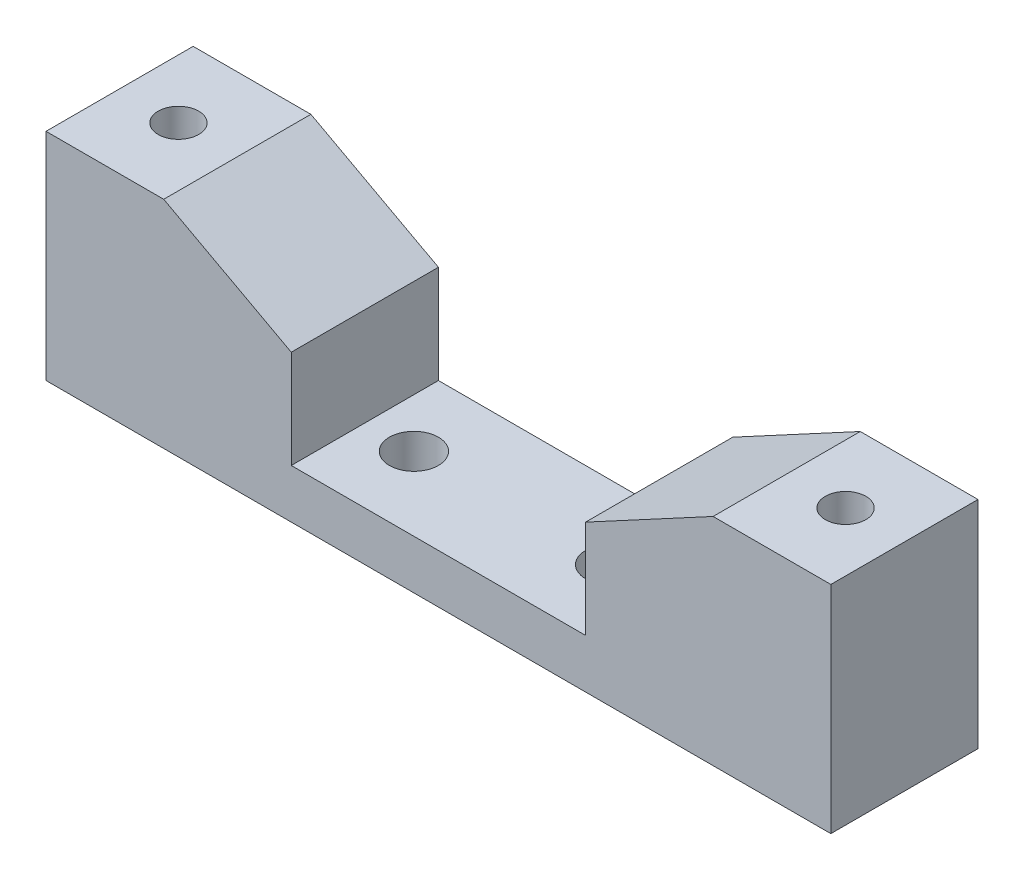
ISO-10303-21;
HEADER;
FILE_DESCRIPTION(('STEP AP214'),'2;1');
FILE_NAME('part.step','',(''),(''),'','','');
FILE_SCHEMA(('AUTOMOTIVE_DESIGN { 1 0 10303 214 1 1 1 1 }'));
ENDSEC;
DATA;
#1=APPLICATION_CONTEXT('core data for automotive mechanical design processes');
#2=APPLICATION_PROTOCOL_DEFINITION('international standard','automotive_design',2000,#1);
#3=PRODUCT_CONTEXT('',#1,'mechanical');
#4=PRODUCT('Part','Part','',(#3));
#5=PRODUCT_RELATED_PRODUCT_CATEGORY('part','',(#4));
#6=PRODUCT_DEFINITION_FORMATION('','',#4);
#7=PRODUCT_DEFINITION_CONTEXT('part definition',#1,'design');
#8=PRODUCT_DEFINITION('design','',#6,#7);
#9=PRODUCT_DEFINITION_SHAPE('','',#8);
#10=(LENGTH_UNIT() NAMED_UNIT(*) SI_UNIT(.MILLI.,.METRE.));
#11=(NAMED_UNIT(*) PLANE_ANGLE_UNIT() SI_UNIT($,.RADIAN.));
#12=(NAMED_UNIT(*) SI_UNIT($,.STERADIAN.) SOLID_ANGLE_UNIT());
#13=UNCERTAINTY_MEASURE_WITH_UNIT(LENGTH_MEASURE(1.E-05),#10,'distance_accuracy_value','');
#14=(GEOMETRIC_REPRESENTATION_CONTEXT(3) GLOBAL_UNCERTAINTY_ASSIGNED_CONTEXT((#13)) GLOBAL_UNIT_ASSIGNED_CONTEXT((#10,
#11,#12)) REPRESENTATION_CONTEXT('',''));
#15=CARTESIAN_POINT('',(0.,0.,0.));
#16=DIRECTION('',(0.,0.,1.));
#17=DIRECTION('',(1.,0.,0.));
#18=AXIS2_PLACEMENT_3D('',#15,#16,#17);
#19=CARTESIAN_POINT('',(-30.9645248071844,-64.5829054663152,7.5));
#20=DIRECTION('',(0.,1.,0.));
#21=DIRECTION('',(-1.,0.,0.));
#22=AXIS2_PLACEMENT_3D('',#19,#20,#21);
#23=CYLINDRICAL_SURFACE('',#22,2.067);
#24=CARTESIAN_POINT('',(-30.9645248071845,19.7319805266102,7.5));
#25=DIRECTION('',(0.,1.,0.));
#26=DIRECTION('',(-1.,0.,0.));
#27=AXIS2_PLACEMENT_3D('',#24,#25,#26);
#28=CIRCLE('',#27,2.067);
#29=CARTESIAN_POINT('',(-33.0315248071845,19.7319805266102,7.5));
#30=VERTEX_POINT('',#29);
#31=EDGE_CURVE('E21',#30,#30,#28,.F.);
#32=ORIENTED_EDGE('',*,*,#31,.F.);
#33=EDGE_LOOP('',(#32));
#34=FACE_BOUND('',#33,.T.);
#35=CARTESIAN_POINT('',(-30.9645248071845,-2.26801947338985,7.5));
#36=DIRECTION('',(0.,1.,0.));
#37=DIRECTION('',(-1.,0.,0.));
#38=AXIS2_PLACEMENT_3D('',#35,#36,#37);
#39=CIRCLE('',#38,2.067);
#40=CARTESIAN_POINT('',(-33.0315248071845,-2.26801947338985,7.5));
#41=VERTEX_POINT('',#40);
#42=EDGE_CURVE('E141',#41,#41,#39,.T.);
#43=ORIENTED_EDGE('',*,*,#42,.F.);
#44=EDGE_LOOP('',(#43));
#45=FACE_BOUND('',#44,.T.);
#46=ADVANCED_FACE('F18',(#34,#45),#23,.F.);
#47=CARTESIAN_POINT('',(37.0354751928156,-64.5829054663151,7.5));
#48=DIRECTION('',(0.,1.,0.));
#49=DIRECTION('',(-1.,0.,0.));
#50=AXIS2_PLACEMENT_3D('',#47,#48,#49);
#51=CYLINDRICAL_SURFACE('',#50,2.067);
#52=CARTESIAN_POINT('',(37.0354751928155,19.7319805266103,7.5));
#53=DIRECTION('',(0.,1.,0.));
#54=DIRECTION('',(-1.,0.,0.));
#55=AXIS2_PLACEMENT_3D('',#52,#53,#54);
#56=CIRCLE('',#55,2.067);
#57=CARTESIAN_POINT('',(34.9684751928155,19.7319805266103,7.5));
#58=VERTEX_POINT('',#57);
#59=EDGE_CURVE('E129',#58,#58,#56,.F.);
#60=ORIENTED_EDGE('',*,*,#59,.F.);
#61=EDGE_LOOP('',(#60));
#62=FACE_BOUND('',#61,.T.);
#63=CARTESIAN_POINT('',(37.0354751928155,-2.26801947338978,7.5));
#64=DIRECTION('',(0.,1.,0.));
#65=DIRECTION('',(-1.,0.,0.));
#66=AXIS2_PLACEMENT_3D('',#63,#64,#65);
#67=CIRCLE('',#66,2.067);
#68=CARTESIAN_POINT('',(34.9684751928155,-2.26801947338978,7.5));
#69=VERTEX_POINT('',#68);
#70=EDGE_CURVE('E112',#69,#69,#67,.T.);
#71=ORIENTED_EDGE('',*,*,#70,.F.);
#72=EDGE_LOOP('',(#71));
#73=FACE_BOUND('',#72,.T.);
#74=ADVANCED_FACE('F148',(#62,#73),#51,.F.);
#75=CARTESIAN_POINT('',(13.0354751928155,-2.26801947338978,7.5));
#76=DIRECTION('',(0.,1.,0.));
#77=DIRECTION('',(-1.,0.,0.));
#78=AXIS2_PLACEMENT_3D('',#75,#76,#77);
#79=CYLINDRICAL_SURFACE('',#78,2.5);
#80=CARTESIAN_POINT('',(13.0354751928155,-2.26801947338978,7.5));
#81=DIRECTION('',(0.,1.,0.));
#82=DIRECTION('',(-1.,0.,0.));
#83=AXIS2_PLACEMENT_3D('',#80,#81,#82);
#84=CIRCLE('',#83,2.5);
#85=CARTESIAN_POINT('',(10.5354751928155,-2.26801947338978,7.5));
#86=VERTEX_POINT('',#85);
#87=EDGE_CURVE('E138',#86,#86,#84,.T.);
#88=ORIENTED_EDGE('',*,*,#87,.F.);
#89=EDGE_LOOP('',(#88));
#90=FACE_BOUND('',#89,.T.);
#91=CARTESIAN_POINT('',(13.0354751928155,2.73198052661022,7.5));
#92=DIRECTION('',(0.,1.,0.));
#93=DIRECTION('',(-1.,0.,0.));
#94=AXIS2_PLACEMENT_3D('',#91,#92,#93);
#95=CIRCLE('',#94,2.5);
#96=CARTESIAN_POINT('',(10.5354751928155,2.73198052661022,7.5));
#97=VERTEX_POINT('',#96);
#98=EDGE_CURVE('E125',#97,#97,#95,.F.);
#99=ORIENTED_EDGE('',*,*,#98,.F.);
#100=EDGE_LOOP('',(#99));
#101=FACE_BOUND('',#100,.T.);
#102=ADVANCED_FACE('F150',(#90,#101),#79,.F.);
#103=CARTESIAN_POINT('',(-6.9645248071845,-2.26801947338978,7.50000000000001));
#104=DIRECTION('',(0.,1.,0.));
#105=DIRECTION('',(-1.,0.,0.));
#106=AXIS2_PLACEMENT_3D('',#103,#104,#105);
#107=CYLINDRICAL_SURFACE('',#106,2.5);
#108=CARTESIAN_POINT('',(-6.9645248071845,-2.26801947338978,7.50000000000001));
#109=DIRECTION('',(0.,1.,0.));
#110=DIRECTION('',(-1.,0.,0.));
#111=AXIS2_PLACEMENT_3D('',#108,#109,#110);
#112=CIRCLE('',#111,2.5);
#113=CARTESIAN_POINT('',(-9.4645248071845,-2.26801947338978,7.50000000000001));
#114=VERTEX_POINT('',#113);
#115=EDGE_CURVE('E134',#114,#114,#112,.T.);
#116=ORIENTED_EDGE('',*,*,#115,.F.);
#117=EDGE_LOOP('',(#116));
#118=FACE_BOUND('',#117,.T.);
#119=CARTESIAN_POINT('',(-6.9645248071845,2.73198052661021,7.50000000000001));
#120=DIRECTION('',(0.,1.,0.));
#121=DIRECTION('',(-1.,0.,0.));
#122=AXIS2_PLACEMENT_3D('',#119,#120,#121);
#123=CIRCLE('',#122,2.5);
#124=CARTESIAN_POINT('',(-9.4645248071845,2.73198052661021,7.50000000000001));
#125=VERTEX_POINT('',#124);
#126=EDGE_CURVE('E121',#125,#125,#123,.F.);
#127=ORIENTED_EDGE('',*,*,#126,.F.);
#128=EDGE_LOOP('',(#127));
#129=FACE_BOUND('',#128,.T.);
#130=ADVANCED_FACE('F157',(#118,#129),#107,.F.);
#131=CARTESIAN_POINT('',(3.0354751928155,6.1190126596373,0.));
#132=DIRECTION('',(0.,0.,1.));
#133=DIRECTION('',(1.,0.,0.));
#134=AXIS2_PLACEMENT_3D('',#131,#132,#133);
#135=PLANE('',#134);
#136=DIRECTION('',(-1.,0.,0.));
#137=VECTOR('',#136,1.);
#138=CARTESIAN_POINT('',(-36.9645248071845,19.7319805266102,0.));
#139=LINE('',#138,#137);
#140=CARTESIAN_POINT('',(-24.9645248071845,19.7319805266102,0.));
#141=VERTEX_POINT('',#140);
#142=CARTESIAN_POINT('',(-36.9645248071845,19.7319805266102,0.));
#143=VERTEX_POINT('',#142);
#144=EDGE_CURVE('E97',#141,#143,#139,.T.);
#145=ORIENTED_EDGE('',*,*,#144,.F.);
#146=DIRECTION('',(-0.880471099922175,0.474099823035018,0.));
#147=VECTOR('',#146,1.);
#148=CARTESIAN_POINT('',(-24.9645248071845,19.7319805266102,0.));
#149=LINE('',#148,#147);
#150=CARTESIAN_POINT('',(-11.9645248071845,12.7319805266102,0.));
#151=VERTEX_POINT('',#150);
#152=EDGE_CURVE('E359',#151,#141,#149,.T.);
#153=ORIENTED_EDGE('',*,*,#152,.F.);
#154=DIRECTION('',(0.,1.,0.));
#155=VECTOR('',#154,1.);
#156=CARTESIAN_POINT('',(-11.9645248071845,12.7319805266102,0.));
#157=LINE('',#156,#155);
#158=CARTESIAN_POINT('',(-11.9645248071845,2.73198052661022,0.));
#159=VERTEX_POINT('',#158);
#160=EDGE_CURVE('E356',#159,#151,#157,.T.);
#161=ORIENTED_EDGE('',*,*,#160,.F.);
#162=DIRECTION('',(-1.,0.,0.));
#163=VECTOR('',#162,1.);
#164=CARTESIAN_POINT('',(-11.9645248071845,2.73198052661021,0.));
#165=LINE('',#164,#163);
#166=CARTESIAN_POINT('',(18.0354751928155,2.73198052661023,0.));
#167=VERTEX_POINT('',#166);
#168=EDGE_CURVE('E351',#167,#159,#165,.T.);
#169=ORIENTED_EDGE('',*,*,#168,.F.);
#170=DIRECTION('',(0.,-1.,0.));
#171=VECTOR('',#170,1.);
#172=CARTESIAN_POINT('',(18.0354751928155,2.73198052661023,0.));
#173=LINE('',#172,#171);
#174=CARTESIAN_POINT('',(18.0354751928155,12.7319805266102,0.));
#175=VERTEX_POINT('',#174);
#176=EDGE_CURVE('E128',#175,#167,#173,.T.);
#177=ORIENTED_EDGE('',*,*,#176,.F.);
#178=DIRECTION('',(-0.880471099922175,-0.474099823035018,0.));
#179=VECTOR('',#178,1.);
#180=CARTESIAN_POINT('',(18.0354751928155,12.7319805266102,0.));
#181=LINE('',#180,#179);
#182=CARTESIAN_POINT('',(31.0354751928155,19.7319805266102,0.));
#183=VERTEX_POINT('',#182);
#184=EDGE_CURVE('E343',#183,#175,#181,.T.);
#185=ORIENTED_EDGE('',*,*,#184,.F.);
#186=DIRECTION('',(-1.,0.,0.));
#187=VECTOR('',#186,1.);
#188=CARTESIAN_POINT('',(31.0354751928155,19.7319805266102,0.));
#189=LINE('',#188,#187);
#190=CARTESIAN_POINT('',(43.0354751928155,19.7319805266102,0.));
#191=VERTEX_POINT('',#190);
#192=EDGE_CURVE('E330',#191,#183,#189,.T.);
#193=ORIENTED_EDGE('',*,*,#192,.F.);
#194=DIRECTION('',(0.,1.,0.));
#195=VECTOR('',#194,1.);
#196=CARTESIAN_POINT('',(43.0354751928155,19.7319805266102,0.));
#197=LINE('',#196,#195);
#198=CARTESIAN_POINT('',(43.0354751928155,-2.26801947338978,0.));
#199=VERTEX_POINT('',#198);
#200=EDGE_CURVE('E133',#199,#191,#197,.T.);
#201=ORIENTED_EDGE('',*,*,#200,.F.);
#202=DIRECTION('',(1.,0.,0.));
#203=VECTOR('',#202,1.);
#204=CARTESIAN_POINT('',(43.0354751928155,-2.26801947338977,0.));
#205=LINE('',#204,#203);
#206=CARTESIAN_POINT('',(-36.9645248071845,-2.26801947338979,0.));
#207=VERTEX_POINT('',#206);
#208=EDGE_CURVE('E110',#207,#199,#205,.T.);
#209=ORIENTED_EDGE('',*,*,#208,.F.);
#210=DIRECTION('',(0.,-1.,0.));
#211=VECTOR('',#210,1.);
#212=CARTESIAN_POINT('',(-36.9645248071845,-2.26801947338979,0.));
#213=LINE('',#212,#211);
#214=EDGE_CURVE('E92',#143,#207,#213,.T.);
#215=ORIENTED_EDGE('',*,*,#214,.F.);
#216=EDGE_LOOP('',(#145,#153,#161,#169,#177,#185,#193,#201,#209,#215));
#217=FACE_BOUND('',#216,.T.);
#218=ADVANCED_FACE('F108',(#217),#135,.F.);
#219=CARTESIAN_POINT('',(-36.9645248071845,19.7319805266102,0.));
#220=DIRECTION('',(0.,1.,0.));
#221=DIRECTION('',(-1.,0.,0.));
#222=AXIS2_PLACEMENT_3D('',#219,#220,#221);
#223=PLANE('',#222);
#224=ORIENTED_EDGE('',*,*,#144,.T.);
#225=DIRECTION('',(0.,0.,1.));
#226=VECTOR('',#225,1.);
#227=CARTESIAN_POINT('',(-36.9645248071845,19.7319805266102,0.));
#228=LINE('',#227,#226);
#229=CARTESIAN_POINT('',(-36.9645248071845,19.7319805266102,15.));
#230=VERTEX_POINT('',#229);
#231=EDGE_CURVE('E100',#230,#143,#228,.F.);
#232=ORIENTED_EDGE('',*,*,#231,.F.);
#233=DIRECTION('',(1.,0.,0.));
#234=VECTOR('',#233,1.);
#235=CARTESIAN_POINT('',(3.0354751928155,19.7319805266102,15.));
#236=LINE('',#235,#234);
#237=CARTESIAN_POINT('',(-24.9645248071845,19.7319805266102,15.));
#238=VERTEX_POINT('',#237);
#239=EDGE_CURVE('E362',#238,#230,#236,.F.);
#240=ORIENTED_EDGE('',*,*,#239,.F.);
#241=DIRECTION('',(0.,0.,1.));
#242=VECTOR('',#241,1.);
#243=CARTESIAN_POINT('',(-24.9645248071845,19.7319805266102,0.));
#244=LINE('',#243,#242);
#245=EDGE_CURVE('E103',#141,#238,#244,.T.);
#246=ORIENTED_EDGE('',*,*,#245,.F.);
#247=EDGE_LOOP('',(#224,#232,#240,#246));
#248=FACE_BOUND('',#247,.T.);
#249=ORIENTED_EDGE('',*,*,#31,.T.);
#250=EDGE_LOOP('',(#249));
#251=FACE_BOUND('',#250,.T.);
#252=ADVANCED_FACE('F98',(#248,#251),#223,.T.);
#253=CARTESIAN_POINT('',(-36.9645248071845,-2.26801947338979,0.));
#254=DIRECTION('',(-1.,0.,0.));
#255=DIRECTION('',(0.,-1.,0.));
#256=AXIS2_PLACEMENT_3D('',#253,#254,#255);
#257=PLANE('',#256);
#258=ORIENTED_EDGE('',*,*,#214,.T.);
#259=DIRECTION('',(0.,0.,1.));
#260=VECTOR('',#259,1.);
#261=CARTESIAN_POINT('',(-36.9645248071845,-2.26801947338979,0.));
#262=LINE('',#261,#260);
#263=CARTESIAN_POINT('',(-36.9645248071845,-2.26801947338979,15.));
#264=VERTEX_POINT('',#263);
#265=EDGE_CURVE('E137',#264,#207,#262,.F.);
#266=ORIENTED_EDGE('',*,*,#265,.F.);
#267=DIRECTION('',(0.,1.,0.));
#268=VECTOR('',#267,1.);
#269=CARTESIAN_POINT('',(-36.9645248071845,6.1190126596373,15.));
#270=LINE('',#269,#268);
#271=EDGE_CURVE('E116',#230,#264,#270,.F.);
#272=ORIENTED_EDGE('',*,*,#271,.F.);
#273=ORIENTED_EDGE('',*,*,#231,.T.);
#274=EDGE_LOOP('',(#258,#266,#272,#273));
#275=FACE_BOUND('',#274,.T.);
#276=ADVANCED_FACE('F114',(#275),#257,.T.);
#277=CARTESIAN_POINT('',(43.0354751928155,-2.26801947338977,0.));
#278=DIRECTION('',(0.,-1.,0.));
#279=DIRECTION('',(1.,0.,0.));
#280=AXIS2_PLACEMENT_3D('',#277,#278,#279);
#281=PLANE('',#280);
#282=ORIENTED_EDGE('',*,*,#208,.T.);
#283=DIRECTION('',(0.,0.,1.));
#284=VECTOR('',#283,1.);
#285=CARTESIAN_POINT('',(43.0354751928155,-2.26801947338977,0.));
#286=LINE('',#285,#284);
#287=CARTESIAN_POINT('',(43.0354751928155,-2.26801947338978,15.));
#288=VERTEX_POINT('',#287);
#289=EDGE_CURVE('E325',#288,#199,#286,.F.);
#290=ORIENTED_EDGE('',*,*,#289,.F.);
#291=DIRECTION('',(1.,0.,0.));
#292=VECTOR('',#291,1.);
#293=CARTESIAN_POINT('',(3.0354751928155,-2.26801947338979,15.));
#294=LINE('',#293,#292);
#295=EDGE_CURVE('E365',#264,#288,#294,.T.);
#296=ORIENTED_EDGE('',*,*,#295,.F.);
#297=ORIENTED_EDGE('',*,*,#265,.T.);
#298=EDGE_LOOP('',(#282,#290,#296,#297));
#299=FACE_BOUND('',#298,.T.);
#300=ORIENTED_EDGE('',*,*,#115,.T.);
#301=EDGE_LOOP('',(#300));
#302=FACE_BOUND('',#301,.T.);
#303=ORIENTED_EDGE('',*,*,#87,.T.);
#304=EDGE_LOOP('',(#303));
#305=FACE_BOUND('',#304,.T.);
#306=ORIENTED_EDGE('',*,*,#42,.T.);
#307=EDGE_LOOP('',(#306));
#308=FACE_BOUND('',#307,.T.);
#309=ORIENTED_EDGE('',*,*,#70,.T.);
#310=EDGE_LOOP('',(#309));
#311=FACE_BOUND('',#310,.T.);
#312=ADVANCED_FACE('F146',(#299,#302,#305,#308,#311),#281,.T.);
#313=CARTESIAN_POINT('',(43.0354751928155,19.7319805266102,0.));
#314=DIRECTION('',(1.,0.,0.));
#315=DIRECTION('',(0.,1.,0.));
#316=AXIS2_PLACEMENT_3D('',#313,#314,#315);
#317=PLANE('',#316);
#318=ORIENTED_EDGE('',*,*,#200,.T.);
#319=DIRECTION('',(0.,0.,1.));
#320=VECTOR('',#319,1.);
#321=CARTESIAN_POINT('',(43.0354751928155,19.7319805266102,0.));
#322=LINE('',#321,#320);
#323=CARTESIAN_POINT('',(43.0354751928155,19.7319805266102,15.));
#324=VERTEX_POINT('',#323);
#325=EDGE_CURVE('E132',#324,#191,#322,.F.);
#326=ORIENTED_EDGE('',*,*,#325,.F.);
#327=DIRECTION('',(0.,1.,0.));
#328=VECTOR('',#327,1.);
#329=CARTESIAN_POINT('',(43.0354751928155,6.1190126596373,15.));
#330=LINE('',#329,#328);
#331=EDGE_CURVE('E334',#288,#324,#330,.T.);
#332=ORIENTED_EDGE('',*,*,#331,.F.);
#333=ORIENTED_EDGE('',*,*,#289,.T.);
#334=EDGE_LOOP('',(#318,#326,#332,#333));
#335=FACE_BOUND('',#334,.T.);
#336=ADVANCED_FACE('F192',(#335),#317,.T.);
#337=CARTESIAN_POINT('',(31.0354751928155,19.7319805266102,0.));
#338=DIRECTION('',(0.,1.,0.));
#339=DIRECTION('',(-1.,0.,0.));
#340=AXIS2_PLACEMENT_3D('',#337,#338,#339);
#341=PLANE('',#340);
#342=ORIENTED_EDGE('',*,*,#192,.T.);
#343=DIRECTION('',(0.,0.,1.));
#344=VECTOR('',#343,1.);
#345=CARTESIAN_POINT('',(31.0354751928155,19.7319805266102,0.));
#346=LINE('',#345,#344);
#347=CARTESIAN_POINT('',(31.0354751928155,19.7319805266102,15.));
#348=VERTEX_POINT('',#347);
#349=EDGE_CURVE('E340',#348,#183,#346,.F.);
#350=ORIENTED_EDGE('',*,*,#349,.F.);
#351=DIRECTION('',(1.,0.,0.));
#352=VECTOR('',#351,1.);
#353=CARTESIAN_POINT('',(3.0354751928155,19.7319805266102,15.));
#354=LINE('',#353,#352);
#355=EDGE_CURVE('E368',#324,#348,#354,.F.);
#356=ORIENTED_EDGE('',*,*,#355,.F.);
#357=ORIENTED_EDGE('',*,*,#325,.T.);
#358=EDGE_LOOP('',(#342,#350,#356,#357));
#359=FACE_BOUND('',#358,.T.);
#360=ORIENTED_EDGE('',*,*,#59,.T.);
#361=EDGE_LOOP('',(#360));
#362=FACE_BOUND('',#361,.T.);
#363=ADVANCED_FACE('F188',(#359,#362),#341,.T.);
#364=CARTESIAN_POINT('',(18.0354751928155,12.7319805266102,0.));
#365=DIRECTION('',(-0.474099823035018,0.880471099922175,0.));
#366=DIRECTION('',(-0.880471099922175,-0.474099823035018,0.));
#367=AXIS2_PLACEMENT_3D('',#364,#365,#366);
#368=PLANE('',#367);
#369=ORIENTED_EDGE('',*,*,#184,.T.);
#370=DIRECTION('',(0.,0.,1.));
#371=VECTOR('',#370,1.);
#372=CARTESIAN_POINT('',(18.0354751928155,12.7319805266102,0.));
#373=LINE('',#372,#371);
#374=CARTESIAN_POINT('',(18.0354751928155,12.7319805266102,15.));
#375=VERTEX_POINT('',#374);
#376=EDGE_CURVE('E345',#375,#175,#373,.F.);
#377=ORIENTED_EDGE('',*,*,#376,.F.);
#378=DIRECTION('',(-0.880471099922175,-0.474099823035017,0.));
#379=VECTOR('',#378,1.);
#380=CARTESIAN_POINT('',(31.0354751928155,19.7319805266102,15.));
#381=LINE('',#380,#379);
#382=EDGE_CURVE('E371',#348,#375,#381,.T.);
#383=ORIENTED_EDGE('',*,*,#382,.F.);
#384=ORIENTED_EDGE('',*,*,#349,.T.);
#385=EDGE_LOOP('',(#369,#377,#383,#384));
#386=FACE_BOUND('',#385,.T.);
#387=ADVANCED_FACE('F184',(#386),#368,.T.);
#388=CARTESIAN_POINT('',(18.0354751928155,2.73198052661023,0.));
#389=DIRECTION('',(-1.,0.,0.));
#390=DIRECTION('',(0.,-1.,0.));
#391=AXIS2_PLACEMENT_3D('',#388,#389,#390);
#392=PLANE('',#391);
#393=ORIENTED_EDGE('',*,*,#176,.T.);
#394=DIRECTION('',(0.,0.,1.));
#395=VECTOR('',#394,1.);
#396=CARTESIAN_POINT('',(18.0354751928155,2.73198052661023,0.));
#397=LINE('',#396,#395);
#398=CARTESIAN_POINT('',(18.0354751928155,2.73198052661023,15.));
#399=VERTEX_POINT('',#398);
#400=EDGE_CURVE('E124',#399,#167,#397,.F.);
#401=ORIENTED_EDGE('',*,*,#400,.F.);
#402=DIRECTION('',(0.,1.,0.));
#403=VECTOR('',#402,1.);
#404=CARTESIAN_POINT('',(18.0354751928155,6.1190126596373,15.));
#405=LINE('',#404,#403);
#406=EDGE_CURVE('E374',#375,#399,#405,.F.);
#407=ORIENTED_EDGE('',*,*,#406,.F.);
#408=ORIENTED_EDGE('',*,*,#376,.T.);
#409=EDGE_LOOP('',(#393,#401,#407,#408));
#410=FACE_BOUND('',#409,.T.);
#411=ADVANCED_FACE('F180',(#410),#392,.T.);
#412=CARTESIAN_POINT('',(-11.9645248071845,2.73198052661021,0.));
#413=DIRECTION('',(0.,1.,0.));
#414=DIRECTION('',(-1.,0.,0.));
#415=AXIS2_PLACEMENT_3D('',#412,#413,#414);
#416=PLANE('',#415);
#417=ORIENTED_EDGE('',*,*,#168,.T.);
#418=DIRECTION('',(0.,0.,1.));
#419=VECTOR('',#418,1.);
#420=CARTESIAN_POINT('',(-11.9645248071845,2.73198052661021,0.));
#421=LINE('',#420,#419);
#422=CARTESIAN_POINT('',(-11.9645248071845,2.73198052661022,15.));
#423=VERTEX_POINT('',#422);
#424=EDGE_CURVE('E353',#423,#159,#421,.F.);
#425=ORIENTED_EDGE('',*,*,#424,.F.);
#426=DIRECTION('',(1.,0.,0.));
#427=VECTOR('',#426,1.);
#428=CARTESIAN_POINT('',(3.0354751928155,2.73198052661023,15.));
#429=LINE('',#428,#427);
#430=EDGE_CURVE('E377',#399,#423,#429,.F.);
#431=ORIENTED_EDGE('',*,*,#430,.F.);
#432=ORIENTED_EDGE('',*,*,#400,.T.);
#433=EDGE_LOOP('',(#417,#425,#431,#432));
#434=FACE_BOUND('',#433,.T.);
#435=ORIENTED_EDGE('',*,*,#126,.T.);
#436=EDGE_LOOP('',(#435));
#437=FACE_BOUND('',#436,.T.);
#438=ORIENTED_EDGE('',*,*,#98,.T.);
#439=EDGE_LOOP('',(#438));
#440=FACE_BOUND('',#439,.T.);
#441=ADVANCED_FACE('F177',(#434,#437,#440),#416,.T.);
#442=CARTESIAN_POINT('',(-11.9645248071845,12.7319805266102,0.));
#443=DIRECTION('',(1.,0.,0.));
#444=DIRECTION('',(0.,1.,0.));
#445=AXIS2_PLACEMENT_3D('',#442,#443,#444);
#446=PLANE('',#445);
#447=ORIENTED_EDGE('',*,*,#160,.T.);
#448=DIRECTION('',(0.,0.,1.));
#449=VECTOR('',#448,1.);
#450=CARTESIAN_POINT('',(-11.9645248071845,12.7319805266102,0.));
#451=LINE('',#450,#449);
#452=CARTESIAN_POINT('',(-11.9645248071845,12.7319805266102,15.));
#453=VERTEX_POINT('',#452);
#454=EDGE_CURVE('E36',#453,#151,#451,.F.);
#455=ORIENTED_EDGE('',*,*,#454,.F.);
#456=DIRECTION('',(0.,1.,0.));
#457=VECTOR('',#456,1.);
#458=CARTESIAN_POINT('',(-11.9645248071845,6.1190126596373,15.));
#459=LINE('',#458,#457);
#460=EDGE_CURVE('E27',#423,#453,#459,.T.);
#461=ORIENTED_EDGE('',*,*,#460,.F.);
#462=ORIENTED_EDGE('',*,*,#424,.T.);
#463=EDGE_LOOP('',(#447,#455,#461,#462));
#464=FACE_BOUND('',#463,.T.);
#465=ADVANCED_FACE('F170',(#464),#446,.T.);
#466=CARTESIAN_POINT('',(-24.9645248071845,19.7319805266102,0.));
#467=DIRECTION('',(0.474099823035018,0.880471099922175,0.));
#468=DIRECTION('',(-0.880471099922175,0.474099823035018,0.));
#469=AXIS2_PLACEMENT_3D('',#466,#467,#468);
#470=PLANE('',#469);
#471=ORIENTED_EDGE('',*,*,#152,.T.);
#472=ORIENTED_EDGE('',*,*,#245,.T.);
#473=DIRECTION('',(-0.880471099922175,0.474099823035017,0.));
#474=VECTOR('',#473,1.);
#475=CARTESIAN_POINT('',(-11.9645248071845,12.7319805266102,15.));
#476=LINE('',#475,#474);
#477=EDGE_CURVE('E11',#453,#238,#476,.T.);
#478=ORIENTED_EDGE('',*,*,#477,.F.);
#479=ORIENTED_EDGE('',*,*,#454,.T.);
#480=EDGE_LOOP('',(#471,#472,#478,#479));
#481=FACE_BOUND('',#480,.T.);
#482=ADVANCED_FACE('F164',(#481),#470,.T.);
#483=CARTESIAN_POINT('',(3.0354751928155,6.1190126596373,15.));
#484=DIRECTION('',(0.,0.,1.));
#485=DIRECTION('',(1.,0.,0.));
#486=AXIS2_PLACEMENT_3D('',#483,#484,#485);
#487=PLANE('',#486);
#488=ORIENTED_EDGE('',*,*,#460,.T.);
#489=ORIENTED_EDGE('',*,*,#477,.T.);
#490=ORIENTED_EDGE('',*,*,#239,.T.);
#491=ORIENTED_EDGE('',*,*,#271,.T.);
#492=ORIENTED_EDGE('',*,*,#295,.T.);
#493=ORIENTED_EDGE('',*,*,#331,.T.);
#494=ORIENTED_EDGE('',*,*,#355,.T.);
#495=ORIENTED_EDGE('',*,*,#382,.T.);
#496=ORIENTED_EDGE('',*,*,#406,.T.);
#497=ORIENTED_EDGE('',*,*,#430,.T.);
#498=EDGE_LOOP('',(#488,#489,#490,#491,#492,#493,#494,#495,#496,#497));
#499=FACE_BOUND('',#498,.T.);
#500=ADVANCED_FACE('F162',(#499),#487,.T.);
#501=CLOSED_SHELL('',(#46,#74,#102,#130,#218,#252,#276,#312,#336,#363,#387,#411,#441,#465,#482,#500));
#502=MANIFOLD_SOLID_BREP('B1',#501);
#503=ADVANCED_BREP_SHAPE_REPRESENTATION('',(#18,#502),#14);
#504=SHAPE_DEFINITION_REPRESENTATION(#9,#503);
ENDSEC;
END-ISO-10303-21;
